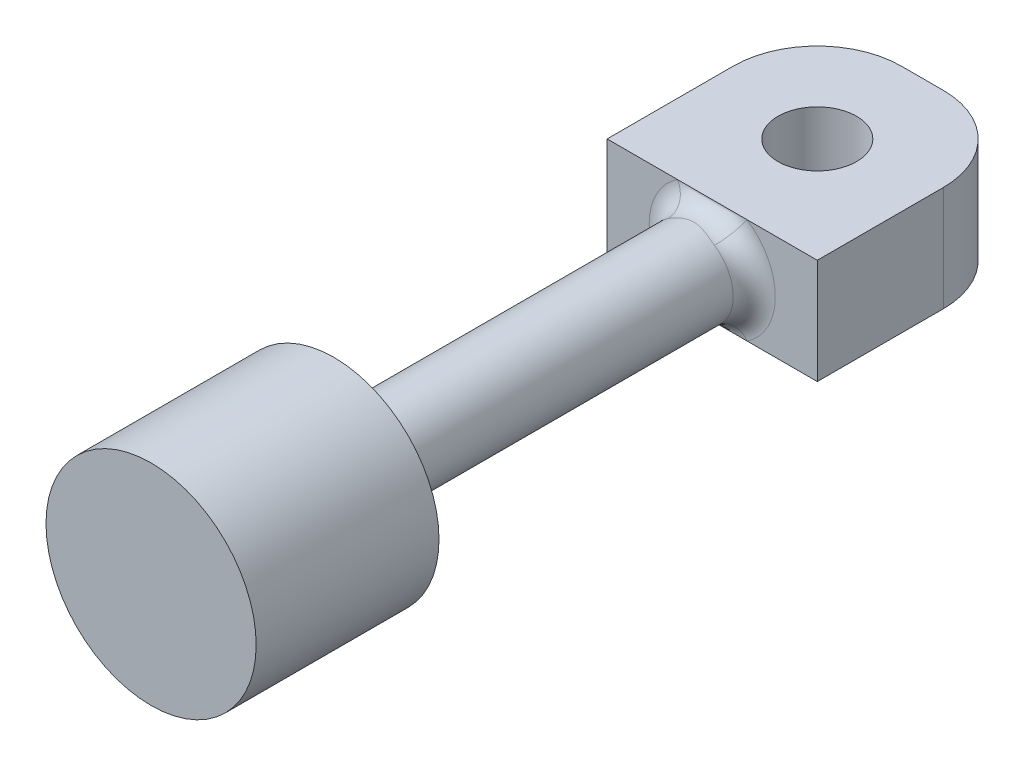
ISO-10303-21;
HEADER;
FILE_DESCRIPTION(('STEP AP214'),'2;1');
FILE_NAME('part.step','',(''),(''),'','','');
FILE_SCHEMA(('AUTOMOTIVE_DESIGN { 1 0 10303 214 1 1 1 1 }'));
ENDSEC;
DATA;
#1=APPLICATION_CONTEXT('core data for automotive mechanical design processes');
#2=APPLICATION_PROTOCOL_DEFINITION('international standard','automotive_design',2000,#1);
#3=PRODUCT_CONTEXT('',#1,'mechanical');
#4=PRODUCT('Part','Part','',(#3));
#5=PRODUCT_RELATED_PRODUCT_CATEGORY('part','',(#4));
#6=PRODUCT_DEFINITION_FORMATION('','',#4);
#7=PRODUCT_DEFINITION_CONTEXT('part definition',#1,'design');
#8=PRODUCT_DEFINITION('design','',#6,#7);
#9=PRODUCT_DEFINITION_SHAPE('','',#8);
#10=(LENGTH_UNIT() NAMED_UNIT(*) SI_UNIT(.MILLI.,.METRE.));
#11=(NAMED_UNIT(*) PLANE_ANGLE_UNIT() SI_UNIT($,.RADIAN.));
#12=(NAMED_UNIT(*) SI_UNIT($,.STERADIAN.) SOLID_ANGLE_UNIT());
#13=UNCERTAINTY_MEASURE_WITH_UNIT(LENGTH_MEASURE(1.E-05),#10,'distance_accuracy_value','');
#14=(GEOMETRIC_REPRESENTATION_CONTEXT(3) GLOBAL_UNCERTAINTY_ASSIGNED_CONTEXT((#13)) GLOBAL_UNIT_ASSIGNED_CONTEXT((#10,
#11,#12)) REPRESENTATION_CONTEXT('',''));
#15=CARTESIAN_POINT('',(0.,0.,0.));
#16=DIRECTION('',(0.,0.,1.));
#17=DIRECTION('',(1.,0.,0.));
#18=AXIS2_PLACEMENT_3D('',#15,#16,#17);
#19=CARTESIAN_POINT('',(0.,-1.25,0.));
#20=DIRECTION('',(0.,0.,1.));
#21=DIRECTION('',(1.,0.,0.));
#22=AXIS2_PLACEMENT_3D('',#19,#20,#21);
#23=PLANE('',#22);
#24=DIRECTION('',(1.,0.,0.));
#25=VECTOR('',#24,1.);
#26=CARTESIAN_POINT('',(0.,-1.25,0.));
#27=LINE('',#26,#25);
#28=CARTESIAN_POINT('',(0.,-1.25,0.));
#29=VERTEX_POINT('',#28);
#30=CARTESIAN_POINT('',(1.67084380241115,-1.25,0.));
#31=VERTEX_POINT('',#30);
#32=EDGE_CURVE('E158',#29,#31,#27,.T.);
#33=ORIENTED_EDGE('',*,*,#32,.T.);
#34=CARTESIAN_POINT('',(2.5,0.,0.));
#35=DIRECTION('',(0.,0.,1.));
#36=DIRECTION('',(1.,0.,0.));
#37=AXIS2_PLACEMENT_3D('',#34,#35,#36);
#38=CIRCLE('',#37,1.5);
#39=CARTESIAN_POINT('',(1.67084380241115,1.25,0.));
#40=VERTEX_POINT('',#39);
#41=EDGE_CURVE('E227',#31,#40,#38,.F.);
#42=ORIENTED_EDGE('',*,*,#41,.T.);
#43=DIRECTION('',(1.,0.,0.));
#44=VECTOR('',#43,1.);
#45=CARTESIAN_POINT('',(0.,1.25,0.));
#46=LINE('',#45,#44);
#47=CARTESIAN_POINT('',(0.,1.25,0.));
#48=VERTEX_POINT('',#47);
#49=EDGE_CURVE('E129',#48,#40,#46,.T.);
#50=ORIENTED_EDGE('',*,*,#49,.F.);
#51=DIRECTION('',(0.,1.,0.));
#52=VECTOR('',#51,1.);
#53=CARTESIAN_POINT('',(0.,-1.25,0.));
#54=LINE('',#53,#52);
#55=EDGE_CURVE('E174',#29,#48,#54,.T.);
#56=ORIENTED_EDGE('',*,*,#55,.F.);
#57=EDGE_LOOP('',(#33,#42,#50,#56));
#58=FACE_BOUND('',#57,.T.);
#59=ADVANCED_FACE('F37',(#58),#23,.T.);
#60=CARTESIAN_POINT('',(2.5,0.,0.));
#61=DIRECTION('',(0.,0.,1.));
#62=DIRECTION('',(1.,0.,0.));
#63=AXIS2_PLACEMENT_3D('',#60,#61,#62);
#64=CYLINDRICAL_SURFACE('',#63,1.);
#65=CARTESIAN_POINT('',(2.5,0.,8.5));
#66=DIRECTION('',(0.,0.,1.));
#67=DIRECTION('',(1.,0.,0.));
#68=AXIS2_PLACEMENT_3D('',#65,#66,#67);
#69=CIRCLE('',#68,1.);
#70=CARTESIAN_POINT('',(3.5,0.,8.5));
#71=VERTEX_POINT('',#70);
#72=EDGE_CURVE('E11',#71,#71,#69,.F.);
#73=ORIENTED_EDGE('',*,*,#72,.T.);
#74=EDGE_LOOP('',(#73));
#75=FACE_BOUND('',#74,.T.);
#76=CARTESIAN_POINT('',(2.5,0.,0.5));
#77=DIRECTION('',(0.,0.,1.));
#78=DIRECTION('',(1.,0.,0.));
#79=AXIS2_PLACEMENT_3D('',#76,#77,#78);
#80=CIRCLE('',#79,1.);
#81=CARTESIAN_POINT('',(1.94722920160743,0.833333333333333,0.5));
#82=VERTEX_POINT('',#81);
#83=CARTESIAN_POINT('',(1.94722920160743,-0.833333333333333,0.5));
#84=VERTEX_POINT('',#83);
#85=EDGE_CURVE('E176',#82,#84,#80,.T.);
#86=ORIENTED_EDGE('',*,*,#85,.T.);
#87=CARTESIAN_POINT('',(1.77625368495232,-0.690066135565932,0.451461678992494));
#88=CARTESIAN_POINT('',(1.92883716273189,-0.850096782033691,-0.190358393908618));
#89=CARTESIAN_POINT('',(1.41438052742847,-1.25,0.));
#90=CARTESIAN_POINT('',(1.79517442832761,-0.709966710720642,0.465607971023034));
#91=CARTESIAN_POINT('',(1.91980847361394,-0.832028730045811,-0.166833125760909));
#92=CARTESIAN_POINT('',(1.44276164249142,-1.25,0.));
#93=CARTESIAN_POINT('',(1.81542331304438,-0.729511061554093,0.476019820260221));
#94=CARTESIAN_POINT('',(1.91504427586367,-0.821844919220158,-0.140470280637435));
#95=CARTESIAN_POINT('',(1.47313496956657,-1.25,0.));
#96=CARTESIAN_POINT('',(1.85781191962799,-0.767050274370984,0.49087949443451));
#97=CARTESIAN_POINT('',(1.91474637960956,-0.813691209952705,-0.0888950609361264));
#98=CARTESIAN_POINT('',(1.53671787944199,-1.25,0.));
#99=CARTESIAN_POINT('',(1.87992758111859,-0.785060201001451,0.495393647500125));
#100=CARTESIAN_POINT('',(1.91871084533525,-0.815066731293708,-0.0636829389507555));
#101=CARTESIAN_POINT('',(1.56989137167788,-1.25,0.));
#102=CARTESIAN_POINT('',(1.93803798822336,-0.828332653107137,0.501505164663201));
#103=CARTESIAN_POINT('',(1.93927814289678,-0.827605678211388,-0.00656457453876137));
#104=CARTESIAN_POINT('',(1.65705698233503,-1.25,0.));
#105=CARTESIAN_POINT('',(1.97510809680122,-0.85229603306466,0.50023428723361));
#106=CARTESIAN_POINT('',(1.96091921167791,-0.843011028846605,0.0233734176193543));
#107=CARTESIAN_POINT('',(1.71266214520183,-1.25,0.));
#108=CARTESIAN_POINT('',(2.05205708319602,-0.895157139300711,0.4923963035708));
#109=CARTESIAN_POINT('',(2.01815471368985,-0.8775967046803,0.0704123197681016));
#110=CARTESIAN_POINT('',(1.82808562479403,-1.25,0.));
#111=CARTESIAN_POINT('',(2.09195344923442,-0.914019070555707,0.485793006307915));
#112=CARTESIAN_POINT('',(2.05342053635577,-0.896785172848845,0.0883220704036785));
#113=CARTESIAN_POINT('',(1.88793017385163,-1.25,0.));
#114=CARTESIAN_POINT('',(2.17638133956542,-0.947344428648788,0.470612726474667));
#115=CARTESIAN_POINT('',(2.13507853923783,-0.933110968533314,0.115526338876348));
#116=CARTESIAN_POINT('',(2.01457200934813,-1.25,0.));
#117=CARTESIAN_POINT('',(2.22104606096117,-0.961448554312796,0.461936386028013));
#118=CARTESIAN_POINT('',(2.18229540717715,-0.950459250408078,0.12482118322152));
#119=CARTESIAN_POINT('',(2.08156909144176,-1.25,0.));
#120=CARTESIAN_POINT('',(2.31196478411317,-0.983267669681309,0.446935958414279));
#121=CARTESIAN_POINT('',(2.28205375020906,-0.977726239563162,0.137257070176644));
#122=CARTESIAN_POINT('',(2.21794717616975,-1.25,0.));
#123=CARTESIAN_POINT('',(2.3582129913156,-0.991003802054727,0.440604125982435));
#124=CARTESIAN_POINT('',(2.3351427742977,-0.988047734390116,0.140660597816397));
#125=CARTESIAN_POINT('',(2.28731948697337,-1.25,0.));
#126=CARTESIAN_POINT('',(2.43238488484835,-0.998095662916237,0.434667301118945));
#127=CARTESIAN_POINT('',(2.42105740886587,-0.997452623083816,0.143608283761576));
#128=CARTESIAN_POINT('',(2.39857732727254,-1.25,0.));
#129=CARTESIAN_POINT('',(2.46005613584839,-0.99958599246396,0.433369379167056));
#130=CARTESIAN_POINT('',(2.45339108808439,-0.999449672236718,0.144176551487355));
#131=CARTESIAN_POINT('',(2.44008420377266,-1.25,0.));
#132=CARTESIAN_POINT('',(2.51544318286278,-1.00026393103126,0.432785955821204));
#133=CARTESIAN_POINT('',(2.51800067470002,-1.00034988540679,0.14444067498318));
#134=CARTESIAN_POINT('',(2.52316477429411,-1.25,0.));
#135=CARTESIAN_POINT('',(2.54315898249787,-0.999451342322642,0.433500627228154));
#136=CARTESIAN_POINT('',(2.55045042932345,-0.999257652779998,0.144137856464308));
#137=CARTESIAN_POINT('',(2.56473847374656,-1.25,0.));
#138=CARTESIAN_POINT('',(2.59845487091523,-0.995528739032176,0.436828721681458));
#139=CARTESIAN_POINT('',(2.61463534493062,-0.994054790126438,0.142557583555506));
#140=CARTESIAN_POINT('',(2.6476823063731,-1.25,0.));
#141=CARTESIAN_POINT('',(2.62603432669167,-0.992412019704754,0.43944768562551));
#142=CARTESIAN_POINT('',(2.64653759219838,-0.989907335839663,0.141268506670842));
#143=CARTESIAN_POINT('',(2.68905149003844,-1.25,0.));
#144=CARTESIAN_POINT('',(2.68076827434398,-0.983915929935954,0.446129671375414));
#145=CARTESIAN_POINT('',(2.70883545774163,-0.978873800329412,0.137311108774016));
#146=CARTESIAN_POINT('',(2.77115241151663,-1.25,0.));
#147=CARTESIAN_POINT('',(2.707922549317,-0.978535441304775,0.45019340667273));
#148=CARTESIAN_POINT('',(2.73938011142874,-0.971929457973244,0.134617682237028));
#149=CARTESIAN_POINT('',(2.8118838239752,-1.25,0.));
#150=CARTESIAN_POINT('',(2.78373250216437,-0.960224985182674,0.462770102378382));
#151=CARTESIAN_POINT('',(2.82300187984199,-0.948892281072629,0.124098705726765));
#152=CARTESIAN_POINT('',(2.92559875324711,-1.25,0.));
#153=CARTESIAN_POINT('',(2.83171631337241,-0.944724761556219,0.472194687807378));
#154=CARTESIAN_POINT('',(2.87355311974939,-0.929850577198626,0.11374334408433));
#155=CARTESIAN_POINT('',(2.99757447006396,-1.25,0.));
#156=CARTESIAN_POINT('',(2.92476870896005,-0.906688344628066,0.488640739025778));
#157=CARTESIAN_POINT('',(2.96220263942754,-0.889067202538646,0.0816781966029243));
#158=CARTESIAN_POINT('',(3.13715306343474,-1.25,0.));
#159=CARTESIAN_POINT('',(2.96985066895664,-0.884187715958376,0.495673983924779));
#160=CARTESIAN_POINT('',(3.00049994604223,-0.866870050222651,0.0592117239336714));
#161=CARTESIAN_POINT('',(3.20477600341427,-1.25,0.));
#162=CARTESIAN_POINT('',(3.03979399461811,-0.84236842856578,0.500393478093026));
#163=CARTESIAN_POINT('',(3.04688763753221,-0.837475084179152,0.0112606835658985));
#164=CARTESIAN_POINT('',(3.30969099193995,-1.25,0.));
#165=CARTESIAN_POINT('',(3.065796864826,-0.825121796302488,0.500625138509801));
#166=CARTESIAN_POINT('',(3.06101388114076,-0.827649045355782,-0.0105711713739422));
#167=CARTESIAN_POINT('',(3.34869529727833,-1.25,0.));
#168=CARTESIAN_POINT('',(3.11614493884474,-0.788264034609287,0.496175958556604));
#169=CARTESIAN_POINT('',(3.080654188027,-0.815287603774195,-0.0592442289666943));
#170=CARTESIAN_POINT('',(3.42421740832696,-1.25,0.));
#171=CARTESIAN_POINT('',(3.14047610644959,-0.768635996734336,0.491457923081184));
#172=CARTESIAN_POINT('',(3.08569534317167,-0.81315584418146,-0.0864070448294501));
#173=CARTESIAN_POINT('',(3.46071415972797,-1.25,0.));
#174=CARTESIAN_POINT('',(3.1636449992085,-0.748047668952692,0.483357321000824));
#175=CARTESIAN_POINT('',(3.08510425327828,-0.817726615140268,-0.114408289333953));
#176=CARTESIAN_POINT('',(3.49546749881274,-1.25,0.));
#177=(BOUNDED_SURFACE() B_SPLINE_SURFACE(3,2,((#87,#88,#89),(#90,#91,#92),(#93,#94,#95),(#96,
#97,#98),(#99,#100,#101),(#102,#103,#104),(#105,#106,#107),(#108,#109,#110),(#111,#112,#113),
(#114,#115,#116),(#117,#118,#119),(#120,#121,#122),(#123,#124,#125),(#126,#127,#128),(#129,#130,
#131),(#132,#133,#134),(#135,#136,#137),(#138,#139,#140),(#141,#142,#143),(#144,#145,#146),
(#147,#148,#149),(#150,#151,#152),(#153,#154,#155),(#156,#157,#158),(#159,#160,#161),(#162,#163,
#164),(#165,#166,#167),(#168,#169,#170),(#171,#172,#173),(#174,#175,#176)),.UNSPECIFIED.,.F.,
.F.,.F.) B_SPLINE_SURFACE_WITH_KNOTS((4,2,2,2,2,2,2,2,2,2,2,2,2,2,4),(3,3),(0.,
0.130040608299928,0.258605761236442,0.456213448509133,0.655173681386589,0.866883089640893,
1.07788672380973,1.20247408451829,1.32707214260187,1.45203420040511,1.57705805587019,
1.80484239277054,2.03148789420838,2.17148758558269,2.31254690942404),(0.,1.),
.UNSPECIFIED.) GEOMETRIC_REPRESENTATION_ITEM() RATIONAL_B_SPLINE_SURFACE(((1.,0.593046572981359,
1.),(1.,0.606805422645073,1.),(1.,0.621347745381121,1.),(1.,0.650713706855895,1.),(1.,
0.665532281656358,1.),(1.,0.702313322712856,1.),(1.,0.723838633182082,1.),(1.,0.763358728971579,
1.),(1.,0.781328340829299,1.),(1.,0.813539016689063,1.),(1.,0.827467373642778,1.),(1.,
0.849163539992706,1.),(1.,0.856951731967779,1.),(1.,0.86410113630927,1.),(1.,0.865607292798284,
1.),(1.,0.866291886128356,1.),(1.,0.865470123094617,1.),(1.,0.861512240342445,1.),(1.,
0.858369366495205,1.),(1.,0.849842672837847,1.),(1.,0.844457745578201,1.),(1.,0.82625126506008,
1.),(1.,0.810955211056081,1.),(1.,0.774309124102591,1.),(1.,0.7529897410997,1.),(1.,
0.715014369295762,1.),(1.,0.69969142357133,1.),(1.,0.668174180580861,1.),(1.,0.65197416601798,
1.),(1.,0.635848556141688,1.))) REPRESENTATION_ITEM('') SURFACE());
#178=CARTESIAN_POINT('',(1.77625368495232,-0.690066135565932,0.451461678992494));
#179=CARTESIAN_POINT('',(1.79517442832761,-0.709966710720642,0.465607971023034));
#180=CARTESIAN_POINT('',(1.81542331304438,-0.729511061554093,0.476019820260221));
#181=CARTESIAN_POINT('',(1.85781191962799,-0.767050274370983,0.49087949443451));
#182=CARTESIAN_POINT('',(1.87992758111859,-0.785060201001451,0.495393647500124));
#183=CARTESIAN_POINT('',(1.93803798822336,-0.828332653107137,0.501505164663201));
#184=CARTESIAN_POINT('',(1.97510809680122,-0.85229603306466,0.50023428723361));
#185=CARTESIAN_POINT('',(2.05205708319602,-0.895157139300711,0.4923963035708));
#186=CARTESIAN_POINT('',(2.09195344923442,-0.914019070555708,0.485793006307915));
#187=CARTESIAN_POINT('',(2.17638133956542,-0.947344428648788,0.470612726474667));
#188=CARTESIAN_POINT('',(2.22104606096117,-0.961448554312796,0.461936386028013));
#189=CARTESIAN_POINT('',(2.31196478411317,-0.983267669681309,0.446935958414279));
#190=CARTESIAN_POINT('',(2.3582129913156,-0.991003802054727,0.440604125982435));
#191=CARTESIAN_POINT('',(2.43238488484835,-0.998095662916237,0.434667301118945));
#192=CARTESIAN_POINT('',(2.46005613584839,-0.99958599246396,0.433369379167056));
#193=CARTESIAN_POINT('',(2.51544318286278,-1.00026393103126,0.432785955821204));
#194=CARTESIAN_POINT('',(2.54315898249787,-0.999451342322642,0.433500627228154));
#195=CARTESIAN_POINT('',(2.59845487091523,-0.995528739032176,0.436828721681458));
#196=CARTESIAN_POINT('',(2.62603432669167,-0.992412019704754,0.43944768562551));
#197=CARTESIAN_POINT('',(2.68076827434398,-0.983915929935954,0.446129671375414));
#198=CARTESIAN_POINT('',(2.707922549317,-0.978535441304775,0.45019340667273));
#199=CARTESIAN_POINT('',(2.78373250216437,-0.960224985182674,0.462770102378382));
#200=CARTESIAN_POINT('',(2.83171631337241,-0.944724761556219,0.472194687807378));
#201=CARTESIAN_POINT('',(2.92476870896005,-0.906688344628066,0.488640739025778));
#202=CARTESIAN_POINT('',(2.96985066895664,-0.884187715958376,0.495673983924779));
#203=CARTESIAN_POINT('',(3.03979399461811,-0.84236842856578,0.500393478093026));
#204=CARTESIAN_POINT('',(3.065796864826,-0.825121796302488,0.500625138509801));
#205=CARTESIAN_POINT('',(3.11614493884474,-0.788264034609288,0.496175958556604));
#206=CARTESIAN_POINT('',(3.14047610644959,-0.768635996734336,0.491457923081184));
#207=CARTESIAN_POINT('',(3.1636449992085,-0.748047668952692,0.483357321000824));
#208=B_SPLINE_CURVE_WITH_KNOTS('',3,(#178,#179,#180,#181,#182,#183,#184,#185,#186,#187,#188,
#189,#190,#191,#192,#193,#194,#195,#196,#197,#198,#199,#200,#201,#202,#203,#204,#205,#206,#207),
.UNSPECIFIED.,.F.,.F.,(4,2,2,2,2,2,2,2,2,2,2,2,2,2,4),(0.,0.130040608299928,0.258605761236442,
0.456213448509133,0.655173681386589,0.866883089640893,1.07788672380973,1.20247408451829,
1.32707214260187,1.45203420040511,1.57705805587019,1.80484239277054,2.03148789420838,
2.17148758558269,2.31254690942404),.UNSPECIFIED.);
#209=CARTESIAN_POINT('',(3.05277079839257,-0.833333333333333,0.5));
#210=VERTEX_POINT('',#209);
#211=EDGE_CURVE('E233',#84,#210,#208,.T.);
#212=ORIENTED_EDGE('',*,*,#211,.T.);
#213=CARTESIAN_POINT('',(2.5,0.,0.5));
#214=DIRECTION('',(0.,0.,1.));
#215=DIRECTION('',(1.,0.,0.));
#216=AXIS2_PLACEMENT_3D('',#213,#214,#215);
#217=CIRCLE('',#216,1.);
#218=CARTESIAN_POINT('',(3.05277079839257,0.833333333333333,0.5));
#219=VERTEX_POINT('',#218);
#220=EDGE_CURVE('E193',#210,#219,#217,.T.);
#221=ORIENTED_EDGE('',*,*,#220,.T.);
#222=CARTESIAN_POINT('',(3.22374631504768,0.690066135565933,0.451461678992494));
#223=CARTESIAN_POINT('',(3.07116283726811,0.850096782033691,-0.190358393908617));
#224=CARTESIAN_POINT('',(3.58561947257153,1.25,0.));
#225=CARTESIAN_POINT('',(3.20482557167239,0.709966710720642,0.465607971023034));
#226=CARTESIAN_POINT('',(3.08019152638606,0.83202873004581,-0.166833125760909));
#227=CARTESIAN_POINT('',(3.55723835750858,1.25,0.));
#228=CARTESIAN_POINT('',(3.18457668695562,0.729511061554093,0.476019820260221));
#229=CARTESIAN_POINT('',(3.08495572413634,0.821844919220157,-0.140470280637435));
#230=CARTESIAN_POINT('',(3.52686503043343,1.25,0.));
#231=CARTESIAN_POINT('',(3.14218808037201,0.767050274370984,0.49087949443451));
#232=CARTESIAN_POINT('',(3.08525362039044,0.813691209952705,-0.0888950609361259));
#233=CARTESIAN_POINT('',(3.46328212055801,1.25,0.));
#234=CARTESIAN_POINT('',(3.12007241888141,0.785060201001451,0.495393647500125));
#235=CARTESIAN_POINT('',(3.08128915466475,0.815066731293708,-0.0636829389507548));
#236=CARTESIAN_POINT('',(3.43010862832212,1.25,0.));
#237=CARTESIAN_POINT('',(3.06196201177664,0.828332653107138,0.501505164663201));
#238=CARTESIAN_POINT('',(3.06072185710322,0.827605678211389,-0.00656457453876042));
#239=CARTESIAN_POINT('',(3.34294301766497,1.25,0.));
#240=CARTESIAN_POINT('',(3.02489190319878,0.85229603306466,0.50023428723361));
#241=CARTESIAN_POINT('',(3.03908078832209,0.843011028846605,0.0233734176193549));
#242=CARTESIAN_POINT('',(3.28733785479817,1.25,0.));
#243=CARTESIAN_POINT('',(2.94794291680398,0.895157139300711,0.4923963035708));
#244=CARTESIAN_POINT('',(2.98184528631015,0.8775967046803,0.070412319768102));
#245=CARTESIAN_POINT('',(3.17191437520597,1.25,0.));
#246=CARTESIAN_POINT('',(2.90804655076558,0.914019070555708,0.485793006307915));
#247=CARTESIAN_POINT('',(2.94657946364423,0.896785172848846,0.088322070403679));
#248=CARTESIAN_POINT('',(3.11206982614837,1.25,0.));
#249=CARTESIAN_POINT('',(2.82361866043458,0.947344428648789,0.470612726474666));
#250=CARTESIAN_POINT('',(2.86492146076217,0.933110968533314,0.115526338876348));
#251=CARTESIAN_POINT('',(2.98542799065187,1.25,0.));
#252=CARTESIAN_POINT('',(2.77895393903883,0.961448554312797,0.461936386028013));
#253=CARTESIAN_POINT('',(2.81770459282284,0.950459250408078,0.12482118322152));
#254=CARTESIAN_POINT('',(2.91843090855823,1.25,0.));
#255=CARTESIAN_POINT('',(2.68803521588682,0.983267669681309,0.446935958414279));
#256=CARTESIAN_POINT('',(2.71794624979093,0.977726239563162,0.137257070176644));
#257=CARTESIAN_POINT('',(2.78205282383025,1.25,0.));
#258=CARTESIAN_POINT('',(2.64178700868439,0.991003802054727,0.440604125982435));
#259=CARTESIAN_POINT('',(2.6648572257023,0.988047734390117,0.140660597816397));
#260=CARTESIAN_POINT('',(2.71268051302663,1.25,0.));
#261=CARTESIAN_POINT('',(2.56761511515165,0.998095662916237,0.434667301118945));
#262=CARTESIAN_POINT('',(2.57894259113413,0.997452623083816,0.143608283761576));
#263=CARTESIAN_POINT('',(2.60142267272745,1.25,0.));
#264=CARTESIAN_POINT('',(2.53994386415161,0.99958599246396,0.433369379167056));
#265=CARTESIAN_POINT('',(2.54660891191561,0.999449672236718,0.144176551487355));
#266=CARTESIAN_POINT('',(2.55991579622734,1.25,0.));
#267=CARTESIAN_POINT('',(2.48455681713721,1.00026393103126,0.432785955821204));
#268=CARTESIAN_POINT('',(2.48199932529997,1.00034988540679,0.14444067498318));
#269=CARTESIAN_POINT('',(2.47683522570589,1.25,0.));
#270=CARTESIAN_POINT('',(2.45684101750212,0.999451342322642,0.433500627228154));
#271=CARTESIAN_POINT('',(2.44954957067654,0.999257652779998,0.144137856464308));
#272=CARTESIAN_POINT('',(2.43526152625344,1.25,0.));
#273=CARTESIAN_POINT('',(2.40154512908476,0.995528739032176,0.436828721681459));
#274=CARTESIAN_POINT('',(2.38536465506937,0.994054790126438,0.142557583555506));
#275=CARTESIAN_POINT('',(2.35231769362689,1.25,0.));
#276=CARTESIAN_POINT('',(2.37396567330833,0.992412019704754,0.43944768562551));
#277=CARTESIAN_POINT('',(2.35346240780162,0.989907335839663,0.141268506670842));
#278=CARTESIAN_POINT('',(2.31094850996156,1.25,0.));
#279=CARTESIAN_POINT('',(2.31923172565602,0.983915929935954,0.446129671375414));
#280=CARTESIAN_POINT('',(2.29116454225837,0.978873800329412,0.137311108774016));
#281=CARTESIAN_POINT('',(2.22884758848336,1.25,0.));
#282=CARTESIAN_POINT('',(2.292077450683,0.978535441304775,0.450193406672731));
#283=CARTESIAN_POINT('',(2.26061988857126,0.971929457973243,0.134617682237028));
#284=CARTESIAN_POINT('',(2.1881161760248,1.25,0.));
#285=CARTESIAN_POINT('',(2.21626749783563,0.960224985182674,0.462770102378383));
#286=CARTESIAN_POINT('',(2.17699812015801,0.948892281072628,0.124098705726765));
#287=CARTESIAN_POINT('',(2.07440124675288,1.25,0.));
#288=CARTESIAN_POINT('',(2.16828368662759,0.944724761556219,0.472194687807378));
#289=CARTESIAN_POINT('',(2.12644688025061,0.929850577198625,0.113743344084329));
#290=CARTESIAN_POINT('',(2.00242552993603,1.25,0.));
#291=CARTESIAN_POINT('',(2.07523129103995,0.906688344628065,0.488640739025778));
#292=CARTESIAN_POINT('',(2.03779736057246,0.889067202538645,0.0816781966029235));
#293=CARTESIAN_POINT('',(1.86284693656525,1.25,0.));
#294=CARTESIAN_POINT('',(2.03014933104335,0.884187715958375,0.495673983924779));
#295=CARTESIAN_POINT('',(1.99950005395777,0.866870050222651,0.0592117239336704));
#296=CARTESIAN_POINT('',(1.79522399658572,1.25,0.));
#297=CARTESIAN_POINT('',(1.96020600538189,0.842368428565779,0.500393478093026));
#298=CARTESIAN_POINT('',(1.95311236246779,0.837475084179151,0.0112606835658975));
#299=CARTESIAN_POINT('',(1.69030900806005,1.25,0.));
#300=CARTESIAN_POINT('',(1.93420313517399,0.825121796302487,0.500625138509801));
#301=CARTESIAN_POINT('',(1.93898611885924,0.827649045355781,-0.0105711713739431));
#302=CARTESIAN_POINT('',(1.65130470272167,1.25,0.));
#303=CARTESIAN_POINT('',(1.88385506115526,0.788264034609287,0.496175958556604));
#304=CARTESIAN_POINT('',(1.919345811973,0.815287603774194,-0.0592442289666952));
#305=CARTESIAN_POINT('',(1.57578259167304,1.25,0.));
#306=CARTESIAN_POINT('',(1.85952389355041,0.768635996734335,0.491457923081184));
#307=CARTESIAN_POINT('',(1.91430465682833,0.813155844181459,-0.086407044829451));
#308=CARTESIAN_POINT('',(1.53928584027202,1.25,0.));
#309=CARTESIAN_POINT('',(1.8363550007915,0.748047668952691,0.483357321000823));
#310=CARTESIAN_POINT('',(1.91489574672173,0.817726615140269,-0.114408289333954));
#311=CARTESIAN_POINT('',(1.50453250118725,1.25,0.));
#312=(BOUNDED_SURFACE() B_SPLINE_SURFACE(3,2,((#222,#223,#224),(#225,#226,#227),(#228,#229,
#230),(#231,#232,#233),(#234,#235,#236),(#237,#238,#239),(#240,#241,#242),(#243,#244,#245),
(#246,#247,#248),(#249,#250,#251),(#252,#253,#254),(#255,#256,#257),(#258,#259,#260),(#261,#262,
#263),(#264,#265,#266),(#267,#268,#269),(#270,#271,#272),(#273,#274,#275),(#276,#277,#278),
(#279,#280,#281),(#282,#283,#284),(#285,#286,#287),(#288,#289,#290),(#291,#292,#293),(#294,#295,
#296),(#297,#298,#299),(#300,#301,#302),(#303,#304,#305),(#306,#307,#308),(#309,#310,#311)),
.UNSPECIFIED.,.F.,.F.,.F.) B_SPLINE_SURFACE_WITH_KNOTS((4,2,2,2,2,2,2,2,2,2,2,2,2,2,4),(3,3),
(0.,0.130040608299928,0.258605761236442,0.456213448509134,0.65517368138659,0.866883089640896,
1.07788672380973,1.20247408451829,1.32707214260187,1.45203420040512,1.57705805587019,
1.80484239277054,2.03148789420838,2.1714875855827,2.31254690942404),(0.,1.),
.UNSPECIFIED.) GEOMETRIC_REPRESENTATION_ITEM() RATIONAL_B_SPLINE_SURFACE(((1.,0.593046572981359,
1.),(1.,0.606805422645073,1.),(1.,0.621347745381121,1.),(1.,0.650713706855895,1.),(1.,
0.665532281656359,1.),(1.,0.702313322712856,1.),(1.,0.723838633182082,1.),(1.,0.76335872897158,
1.),(1.,0.7813283408293,1.),(1.,0.813539016689064,1.),(1.,0.827467373642778,1.),(1.,
0.849163539992707,1.),(1.,0.856951731967779,1.),(1.,0.86410113630927,1.),(1.,0.865607292798284,
1.),(1.,0.866291886128356,1.),(1.,0.865470123094617,1.),(1.,0.861512240342445,1.),(1.,
0.858369366495205,1.),(1.,0.849842672837846,1.),(1.,0.8444577455782,1.),(1.,0.826251265060079,
1.),(1.,0.81095521105608,1.),(1.,0.77430912410259,1.),(1.,0.7529897410997,1.),(1.,
0.715014369295761,1.),(1.,0.699691423571329,1.),(1.,0.66817418058086,1.),(1.,0.65197416601798,
1.),(1.,0.635848556141687,1.))) REPRESENTATION_ITEM('') SURFACE());
#313=CARTESIAN_POINT('',(3.22374631504768,0.690066135565933,0.451461678992494));
#314=CARTESIAN_POINT('',(3.20482557167239,0.709966710720642,0.465607971023034));
#315=CARTESIAN_POINT('',(3.18457668695562,0.729511061554093,0.476019820260221));
#316=CARTESIAN_POINT('',(3.14218808037201,0.767050274370984,0.49087949443451));
#317=CARTESIAN_POINT('',(3.12007241888141,0.785060201001451,0.495393647500125));
#318=CARTESIAN_POINT('',(3.06196201177664,0.828332653107138,0.501505164663201));
#319=CARTESIAN_POINT('',(3.02489190319878,0.85229603306466,0.50023428723361));
#320=CARTESIAN_POINT('',(2.94794291680398,0.895157139300711,0.4923963035708));
#321=CARTESIAN_POINT('',(2.90804655076558,0.914019070555708,0.485793006307915));
#322=CARTESIAN_POINT('',(2.82361866043458,0.947344428648789,0.470612726474666));
#323=CARTESIAN_POINT('',(2.77895393903883,0.961448554312797,0.461936386028013));
#324=CARTESIAN_POINT('',(2.68803521588682,0.983267669681309,0.446935958414279));
#325=CARTESIAN_POINT('',(2.64178700868439,0.991003802054727,0.440604125982435));
#326=CARTESIAN_POINT('',(2.56761511515165,0.998095662916237,0.434667301118945));
#327=CARTESIAN_POINT('',(2.53994386415161,0.999585992463961,0.433369379167056));
#328=CARTESIAN_POINT('',(2.48455681713721,1.00026393103126,0.432785955821204));
#329=CARTESIAN_POINT('',(2.45684101750212,0.999451342322642,0.433500627228154));
#330=CARTESIAN_POINT('',(2.40154512908476,0.995528739032176,0.436828721681459));
#331=CARTESIAN_POINT('',(2.37396567330833,0.992412019704754,0.43944768562551));
#332=CARTESIAN_POINT('',(2.31923172565602,0.983915929935954,0.446129671375414));
#333=CARTESIAN_POINT('',(2.292077450683,0.978535441304775,0.450193406672731));
#334=CARTESIAN_POINT('',(2.21626749783563,0.960224985182674,0.462770102378383));
#335=CARTESIAN_POINT('',(2.16828368662759,0.944724761556219,0.472194687807378));
#336=CARTESIAN_POINT('',(2.07523129103995,0.906688344628065,0.488640739025778));
#337=CARTESIAN_POINT('',(2.03014933104335,0.884187715958375,0.495673983924779));
#338=CARTESIAN_POINT('',(1.96020600538189,0.842368428565779,0.500393478093026));
#339=CARTESIAN_POINT('',(1.93420313517399,0.825121796302487,0.500625138509801));
#340=CARTESIAN_POINT('',(1.88385506115526,0.788264034609287,0.496175958556604));
#341=CARTESIAN_POINT('',(1.85952389355041,0.768635996734336,0.491457923081184));
#342=CARTESIAN_POINT('',(1.8363550007915,0.748047668952691,0.483357321000823));
#343=B_SPLINE_CURVE_WITH_KNOTS('',3,(#313,#314,#315,#316,#317,#318,#319,#320,#321,#322,#323,
#324,#325,#326,#327,#328,#329,#330,#331,#332,#333,#334,#335,#336,#337,#338,#339,#340,#341,#342),
.UNSPECIFIED.,.F.,.F.,(4,2,2,2,2,2,2,2,2,2,2,2,2,2,4),(0.,0.130040608299928,0.258605761236442,
0.456213448509134,0.65517368138659,0.866883089640896,1.07788672380973,1.20247408451829,
1.32707214260187,1.45203420040512,1.57705805587019,1.80484239277054,2.03148789420838,
2.1714875855827,2.31254690942404),.UNSPECIFIED.);
#344=EDGE_CURVE('E185',#219,#82,#343,.T.);
#345=ORIENTED_EDGE('',*,*,#344,.T.);
#346=EDGE_LOOP('',(#86,#212,#221,#345));
#347=FACE_BOUND('',#346,.T.);
#348=ADVANCED_FACE('F195',(#75,#347),#64,.T.);
#349=CARTESIAN_POINT('',(3.32915619758885,1.25,0.));
#350=VERTEX_POINT('',#349);
#351=CARTESIAN_POINT('',(5.,1.25,0.));
#352=VERTEX_POINT('',#351);
#353=EDGE_CURVE('E116',#350,#352,#46,.T.);
#354=ORIENTED_EDGE('',*,*,#353,.F.);
#355=CARTESIAN_POINT('',(2.5,0.,0.));
#356=DIRECTION('',(0.,0.,1.));
#357=DIRECTION('',(1.,0.,0.));
#358=AXIS2_PLACEMENT_3D('',#355,#356,#357);
#359=CIRCLE('',#358,1.5);
#360=CARTESIAN_POINT('',(3.32915619758885,-1.25,0.));
#361=VERTEX_POINT('',#360);
#362=EDGE_CURVE('E52',#350,#361,#359,.F.);
#363=ORIENTED_EDGE('',*,*,#362,.T.);
#364=CARTESIAN_POINT('',(5.,-1.25,0.));
#365=VERTEX_POINT('',#364);
#366=EDGE_CURVE('E133',#361,#365,#27,.T.);
#367=ORIENTED_EDGE('',*,*,#366,.T.);
#368=DIRECTION('',(0.,1.,0.));
#369=VECTOR('',#368,1.);
#370=CARTESIAN_POINT('',(5.,-1.25,0.));
#371=LINE('',#370,#369);
#372=EDGE_CURVE('E131',#365,#352,#371,.T.);
#373=ORIENTED_EDGE('',*,*,#372,.T.);
#374=EDGE_LOOP('',(#354,#363,#367,#373));
#375=FACE_BOUND('',#374,.T.);
#376=ADVANCED_FACE('F132',(#375),#23,.T.);
#377=CARTESIAN_POINT('',(0.,-1.25,0.));
#378=DIRECTION('',(1.,0.,0.));
#379=DIRECTION('',(0.,0.,-1.));
#380=AXIS2_PLACEMENT_3D('',#377,#378,#379);
#381=PLANE('',#380);
#382=ORIENTED_EDGE('',*,*,#55,.T.);
#383=DIRECTION('',(0.,0.,-1.));
#384=VECTOR('',#383,1.);
#385=CARTESIAN_POINT('',(0.,1.25,0.));
#386=LINE('',#385,#384);
#387=CARTESIAN_POINT('',(0.,1.25,-3.));
#388=VERTEX_POINT('',#387);
#389=EDGE_CURVE('E152',#48,#388,#386,.T.);
#390=ORIENTED_EDGE('',*,*,#389,.T.);
#391=DIRECTION('',(0.,1.,0.));
#392=VECTOR('',#391,1.);
#393=CARTESIAN_POINT('',(0.,-1.25,-3.));
#394=LINE('',#393,#392);
#395=CARTESIAN_POINT('',(0.,-1.25,-3.));
#396=VERTEX_POINT('',#395);
#397=EDGE_CURVE('E177',#396,#388,#394,.T.);
#398=ORIENTED_EDGE('',*,*,#397,.F.);
#399=DIRECTION('',(0.,0.,-1.));
#400=VECTOR('',#399,1.);
#401=CARTESIAN_POINT('',(0.,-1.25,0.));
#402=LINE('',#401,#400);
#403=EDGE_CURVE('E138',#29,#396,#402,.T.);
#404=ORIENTED_EDGE('',*,*,#403,.F.);
#405=EDGE_LOOP('',(#382,#390,#398,#404));
#406=FACE_BOUND('',#405,.T.);
#407=ADVANCED_FACE('F266',(#406),#381,.F.);
#408=CARTESIAN_POINT('',(2.,-1.25,-3.));
#409=DIRECTION('',(0.,1.,0.));
#410=DIRECTION('',(0.,0.,1.));
#411=AXIS2_PLACEMENT_3D('',#408,#409,#410);
#412=CYLINDRICAL_SURFACE('',#411,2.);
#413=ORIENTED_EDGE('',*,*,#397,.T.);
#414=CARTESIAN_POINT('',(2.,1.25,-3.));
#415=DIRECTION('',(0.,1.,0.));
#416=DIRECTION('',(0.,0.,1.));
#417=AXIS2_PLACEMENT_3D('',#414,#415,#416);
#418=CIRCLE('',#417,2.);
#419=CARTESIAN_POINT('',(2.,1.25,-5.));
#420=VERTEX_POINT('',#419);
#421=EDGE_CURVE('E149',#388,#420,#418,.F.);
#422=ORIENTED_EDGE('',*,*,#421,.T.);
#423=DIRECTION('',(0.,1.,0.));
#424=VECTOR('',#423,1.);
#425=CARTESIAN_POINT('',(2.,-1.25,-5.));
#426=LINE('',#425,#424);
#427=CARTESIAN_POINT('',(2.,-1.25,-5.));
#428=VERTEX_POINT('',#427);
#429=EDGE_CURVE('E179',#428,#420,#426,.T.);
#430=ORIENTED_EDGE('',*,*,#429,.F.);
#431=CARTESIAN_POINT('',(2.,-1.25,-3.));
#432=DIRECTION('',(0.,1.,0.));
#433=DIRECTION('',(0.,0.,1.));
#434=AXIS2_PLACEMENT_3D('',#431,#432,#433);
#435=CIRCLE('',#434,2.);
#436=EDGE_CURVE('E169',#396,#428,#435,.F.);
#437=ORIENTED_EDGE('',*,*,#436,.F.);
#438=EDGE_LOOP('',(#413,#422,#430,#437));
#439=FACE_BOUND('',#438,.T.);
#440=ADVANCED_FACE('F269',(#439),#412,.T.);
#441=CARTESIAN_POINT('',(0.,-1.25,-5.));
#442=DIRECTION('',(0.,0.,1.));
#443=DIRECTION('',(1.,0.,0.));
#444=AXIS2_PLACEMENT_3D('',#441,#442,#443);
#445=PLANE('',#444);
#446=ORIENTED_EDGE('',*,*,#429,.T.);
#447=DIRECTION('',(1.,0.,0.));
#448=VECTOR('',#447,1.);
#449=CARTESIAN_POINT('',(0.,1.25,-5.));
#450=LINE('',#449,#448);
#451=CARTESIAN_POINT('',(3.,1.25,-5.));
#452=VERTEX_POINT('',#451);
#453=EDGE_CURVE('E143',#420,#452,#450,.T.);
#454=ORIENTED_EDGE('',*,*,#453,.T.);
#455=DIRECTION('',(0.,1.,0.));
#456=VECTOR('',#455,1.);
#457=CARTESIAN_POINT('',(3.,-1.25,-5.));
#458=LINE('',#457,#456);
#459=CARTESIAN_POINT('',(3.,-1.25,-5.));
#460=VERTEX_POINT('',#459);
#461=EDGE_CURVE('E181',#460,#452,#458,.T.);
#462=ORIENTED_EDGE('',*,*,#461,.F.);
#463=DIRECTION('',(1.,0.,0.));
#464=VECTOR('',#463,1.);
#465=CARTESIAN_POINT('',(0.,-1.25,-5.));
#466=LINE('',#465,#464);
#467=EDGE_CURVE('E167',#428,#460,#466,.T.);
#468=ORIENTED_EDGE('',*,*,#467,.F.);
#469=EDGE_LOOP('',(#446,#454,#462,#468));
#470=FACE_BOUND('',#469,.T.);
#471=ADVANCED_FACE('F273',(#470),#445,.F.);
#472=CARTESIAN_POINT('',(3.,-1.25,-3.));
#473=DIRECTION('',(0.,1.,0.));
#474=DIRECTION('',(0.,0.,1.));
#475=AXIS2_PLACEMENT_3D('',#472,#473,#474);
#476=CYLINDRICAL_SURFACE('',#475,2.);
#477=ORIENTED_EDGE('',*,*,#461,.T.);
#478=CARTESIAN_POINT('',(3.,1.25,-3.));
#479=DIRECTION('',(0.,1.,0.));
#480=DIRECTION('',(0.,0.,1.));
#481=AXIS2_PLACEMENT_3D('',#478,#479,#480);
#482=CIRCLE('',#481,2.);
#483=CARTESIAN_POINT('',(5.,1.25,-3.));
#484=VERTEX_POINT('',#483);
#485=EDGE_CURVE('E141',#484,#452,#482,.T.);
#486=ORIENTED_EDGE('',*,*,#485,.F.);
#487=DIRECTION('',(0.,1.,0.));
#488=VECTOR('',#487,1.);
#489=CARTESIAN_POINT('',(5.,-1.25,-3.));
#490=LINE('',#489,#488);
#491=CARTESIAN_POINT('',(5.,-1.25,-3.));
#492=VERTEX_POINT('',#491);
#493=EDGE_CURVE('E137',#492,#484,#490,.T.);
#494=ORIENTED_EDGE('',*,*,#493,.F.);
#495=CARTESIAN_POINT('',(3.,-1.25,-3.));
#496=DIRECTION('',(0.,1.,0.));
#497=DIRECTION('',(0.,0.,1.));
#498=AXIS2_PLACEMENT_3D('',#495,#496,#497);
#499=CIRCLE('',#498,2.);
#500=EDGE_CURVE('E164',#492,#460,#499,.T.);
#501=ORIENTED_EDGE('',*,*,#500,.T.);
#502=EDGE_LOOP('',(#477,#486,#494,#501));
#503=FACE_BOUND('',#502,.T.);
#504=ADVANCED_FACE('F277',(#503),#476,.T.);
#505=CARTESIAN_POINT('',(2.5,-1.25,-2.5));
#506=DIRECTION('',(0.,1.,0.));
#507=DIRECTION('',(0.,0.,1.));
#508=AXIS2_PLACEMENT_3D('',#505,#506,#507);
#509=CYLINDRICAL_SURFACE('',#508,0.935);
#510=CARTESIAN_POINT('',(2.5,-1.25,-2.5));
#511=DIRECTION('',(0.,1.,0.));
#512=DIRECTION('',(0.,0.,1.));
#513=AXIS2_PLACEMENT_3D('',#510,#511,#512);
#514=CIRCLE('',#513,0.935);
#515=CARTESIAN_POINT('',(2.5,-1.25,-1.565));
#516=VERTEX_POINT('',#515);
#517=EDGE_CURVE('E155',#516,#516,#514,.T.);
#518=ORIENTED_EDGE('',*,*,#517,.F.);
#519=EDGE_LOOP('',(#518));
#520=FACE_BOUND('',#519,.T.);
#521=CARTESIAN_POINT('',(2.5,1.25,-2.5));
#522=DIRECTION('',(0.,1.,0.));
#523=DIRECTION('',(0.,0.,1.));
#524=AXIS2_PLACEMENT_3D('',#521,#522,#523);
#525=CIRCLE('',#524,0.935);
#526=CARTESIAN_POINT('',(2.5,1.25,-1.565));
#527=VERTEX_POINT('',#526);
#528=EDGE_CURVE('E127',#527,#527,#525,.T.);
#529=ORIENTED_EDGE('',*,*,#528,.T.);
#530=EDGE_LOOP('',(#529));
#531=FACE_BOUND('',#530,.T.);
#532=ADVANCED_FACE('F280',(#520,#531),#509,.F.);
#533=CARTESIAN_POINT('',(5.,-1.25,0.));
#534=DIRECTION('',(1.,0.,0.));
#535=DIRECTION('',(0.,0.,-1.));
#536=AXIS2_PLACEMENT_3D('',#533,#534,#535);
#537=PLANE('',#536);
#538=ORIENTED_EDGE('',*,*,#493,.T.);
#539=DIRECTION('',(0.,0.,-1.));
#540=VECTOR('',#539,1.);
#541=CARTESIAN_POINT('',(5.,1.25,0.));
#542=LINE('',#541,#540);
#543=EDGE_CURVE('E122',#352,#484,#542,.T.);
#544=ORIENTED_EDGE('',*,*,#543,.F.);
#545=ORIENTED_EDGE('',*,*,#372,.F.);
#546=DIRECTION('',(0.,0.,-1.));
#547=VECTOR('',#546,1.);
#548=CARTESIAN_POINT('',(5.,-1.25,0.));
#549=LINE('',#548,#547);
#550=EDGE_CURVE('E161',#365,#492,#549,.T.);
#551=ORIENTED_EDGE('',*,*,#550,.T.);
#552=EDGE_LOOP('',(#538,#544,#545,#551));
#553=FACE_BOUND('',#552,.T.);
#554=ADVANCED_FACE('F140',(#553),#537,.T.);
#555=CARTESIAN_POINT('',(0.,-1.25,0.));
#556=DIRECTION('',(0.,1.,0.));
#557=DIRECTION('',(0.,0.,1.));
#558=AXIS2_PLACEMENT_3D('',#555,#556,#557);
#559=PLANE('',#558);
#560=ORIENTED_EDGE('',*,*,#517,.T.);
#561=EDGE_LOOP('',(#560));
#562=FACE_BOUND('',#561,.T.);
#563=ORIENTED_EDGE('',*,*,#32,.F.);
#564=ORIENTED_EDGE('',*,*,#403,.T.);
#565=ORIENTED_EDGE('',*,*,#436,.T.);
#566=ORIENTED_EDGE('',*,*,#467,.T.);
#567=ORIENTED_EDGE('',*,*,#500,.F.);
#568=ORIENTED_EDGE('',*,*,#550,.F.);
#569=ORIENTED_EDGE('',*,*,#366,.F.);
#570=EDGE_CURVE('E162',#31,#361,#27,.T.);
#571=ORIENTED_EDGE('',*,*,#570,.F.);
#572=EDGE_LOOP('',(#563,#564,#565,#566,#567,#568,#569,#571));
#573=FACE_BOUND('',#572,.T.);
#574=ADVANCED_FACE('F259',(#562,#573),#559,.F.);
#575=CARTESIAN_POINT('',(0.,1.25,0.));
#576=DIRECTION('',(0.,1.,0.));
#577=DIRECTION('',(0.,0.,1.));
#578=AXIS2_PLACEMENT_3D('',#575,#576,#577);
#579=PLANE('',#578);
#580=ORIENTED_EDGE('',*,*,#528,.F.);
#581=EDGE_LOOP('',(#580));
#582=FACE_BOUND('',#581,.T.);
#583=ORIENTED_EDGE('',*,*,#49,.T.);
#584=EDGE_CURVE('E125',#40,#350,#46,.T.);
#585=ORIENTED_EDGE('',*,*,#584,.T.);
#586=ORIENTED_EDGE('',*,*,#353,.T.);
#587=ORIENTED_EDGE('',*,*,#543,.T.);
#588=ORIENTED_EDGE('',*,*,#485,.T.);
#589=ORIENTED_EDGE('',*,*,#453,.F.);
#590=ORIENTED_EDGE('',*,*,#421,.F.);
#591=ORIENTED_EDGE('',*,*,#389,.F.);
#592=EDGE_LOOP('',(#583,#585,#586,#587,#588,#589,#590,#591));
#593=FACE_BOUND('',#592,.T.);
#594=ADVANCED_FACE('F119',(#582,#593),#579,.T.);
#595=CARTESIAN_POINT('',(3.32915619758884,1.25000000000001,0.5));
#596=DIRECTION('',(0.833333333333338,-0.55277079839256,0.));
#597=DIRECTION('',(0.55277079839256,0.833333333333338,0.));
#598=AXIS2_PLACEMENT_3D('',#595,#596,#597);
#599=CIRCLE('',#598,0.5);
#600=EDGE_CURVE('E240',#350,#219,#599,.F.);
#601=ORIENTED_EDGE('',*,*,#600,.F.);
#602=ORIENTED_EDGE('',*,*,#584,.F.);
#603=CARTESIAN_POINT('',(1.67084380241115,1.25,0.5));
#604=DIRECTION('',(0.833333333333333,0.552770798392567,0.));
#605=DIRECTION('',(-0.552770798392567,0.833333333333333,0.));
#606=AXIS2_PLACEMENT_3D('',#603,#604,#605);
#607=CIRCLE('',#606,0.5);
#608=EDGE_CURVE('E432',#82,#40,#607,.T.);
#609=ORIENTED_EDGE('',*,*,#608,.F.);
#610=ORIENTED_EDGE('',*,*,#344,.F.);
#611=EDGE_LOOP('',(#601,#602,#609,#610));
#612=FACE_BOUND('',#611,.T.);
#613=ADVANCED_FACE('F203',(#612),#312,.F.);
#614=CARTESIAN_POINT('',(2.5,0.,0.5));
#615=DIRECTION('',(0.,0.,1.));
#616=DIRECTION('',(1.,0.,0.));
#617=AXIS2_PLACEMENT_3D('',#614,#615,#616);
#618=TOROIDAL_SURFACE('',#617,1.5,0.5);
#619=ORIENTED_EDGE('',*,*,#608,.T.);
#620=ORIENTED_EDGE('',*,*,#41,.F.);
#621=CARTESIAN_POINT('',(1.67084380241115,-1.25,0.5));
#622=DIRECTION('',(-0.833333333333333,0.552770798392567,0.));
#623=DIRECTION('',(-0.552770798392567,-0.833333333333333,0.));
#624=AXIS2_PLACEMENT_3D('',#621,#622,#623);
#625=CIRCLE('',#624,0.5);
#626=EDGE_CURVE('E60',#84,#31,#625,.T.);
#627=ORIENTED_EDGE('',*,*,#626,.F.);
#628=ORIENTED_EDGE('',*,*,#85,.F.);
#629=EDGE_LOOP('',(#619,#620,#627,#628));
#630=FACE_BOUND('',#629,.T.);
#631=ADVANCED_FACE('F209',(#630),#618,.F.);
#632=CARTESIAN_POINT('',(2.5,0.,0.5));
#633=DIRECTION('',(0.,0.,1.));
#634=DIRECTION('',(1.,0.,0.));
#635=AXIS2_PLACEMENT_3D('',#632,#633,#634);
#636=TOROIDAL_SURFACE('',#635,1.5,0.5);
#637=ORIENTED_EDGE('',*,*,#600,.T.);
#638=ORIENTED_EDGE('',*,*,#220,.F.);
#639=CARTESIAN_POINT('',(3.32915619758885,-1.25,0.5));
#640=DIRECTION('',(0.833333333333333,0.552770798392567,0.));
#641=DIRECTION('',(-0.552770798392567,0.833333333333333,0.));
#642=AXIS2_PLACEMENT_3D('',#639,#640,#641);
#643=CIRCLE('',#642,0.5);
#644=EDGE_CURVE('E236',#361,#210,#643,.T.);
#645=ORIENTED_EDGE('',*,*,#644,.F.);
#646=ORIENTED_EDGE('',*,*,#362,.F.);
#647=EDGE_LOOP('',(#637,#638,#645,#646));
#648=FACE_BOUND('',#647,.T.);
#649=ADVANCED_FACE('F351',(#648),#636,.F.);
#650=ORIENTED_EDGE('',*,*,#626,.T.);
#651=ORIENTED_EDGE('',*,*,#570,.T.);
#652=ORIENTED_EDGE('',*,*,#644,.T.);
#653=ORIENTED_EDGE('',*,*,#211,.F.);
#654=EDGE_LOOP('',(#650,#651,#652,#653));
#655=FACE_BOUND('',#654,.T.);
#656=ADVANCED_FACE('F254',(#655),#177,.F.);
#657=CARTESIAN_POINT('',(2.5,0.,0.));
#658=DIRECTION('',(0.,0.,1.));
#659=DIRECTION('',(1.,0.,0.));
#660=AXIS2_PLACEMENT_3D('',#657,#658,#659);
#661=CYLINDRICAL_SURFACE('',#660,2.5);
#662=CARTESIAN_POINT('',(2.5,0.,13.35));
#663=DIRECTION('',(0.,0.,1.));
#664=DIRECTION('',(1.,0.,0.));
#665=AXIS2_PLACEMENT_3D('',#662,#663,#664);
#666=CIRCLE('',#665,2.5);
#667=CARTESIAN_POINT('',(5.,0.,13.35));
#668=VERTEX_POINT('',#667);
#669=EDGE_CURVE('E437',#668,#668,#666,.T.);
#670=ORIENTED_EDGE('',*,*,#669,.F.);
#671=EDGE_LOOP('',(#670));
#672=FACE_BOUND('',#671,.T.);
#673=CARTESIAN_POINT('',(2.5,0.,9.));
#674=DIRECTION('',(0.,0.,1.));
#675=DIRECTION('',(1.,0.,0.));
#676=AXIS2_PLACEMENT_3D('',#673,#674,#675);
#677=CIRCLE('',#676,2.5);
#678=CARTESIAN_POINT('',(5.,0.,9.));
#679=VERTEX_POINT('',#678);
#680=EDGE_CURVE('E238',#679,#679,#677,.T.);
#681=ORIENTED_EDGE('',*,*,#680,.T.);
#682=EDGE_LOOP('',(#681));
#683=FACE_BOUND('',#682,.T.);
#684=ADVANCED_FACE('F369',(#672,#683),#661,.T.);
#685=CARTESIAN_POINT('',(0.,0.,9.));
#686=DIRECTION('',(0.,0.,1.));
#687=DIRECTION('',(1.,0.,0.));
#688=AXIS2_PLACEMENT_3D('',#685,#686,#687);
#689=PLANE('',#688);
#690=CARTESIAN_POINT('',(2.5,0.,9.));
#691=DIRECTION('',(0.,0.,1.));
#692=DIRECTION('',(1.,0.,0.));
#693=AXIS2_PLACEMENT_3D('',#690,#691,#692);
#694=CIRCLE('',#693,1.5);
#695=CARTESIAN_POINT('',(4.,0.,9.));
#696=VERTEX_POINT('',#695);
#697=EDGE_CURVE('E45',#696,#696,#694,.T.);
#698=ORIENTED_EDGE('',*,*,#697,.T.);
#699=EDGE_LOOP('',(#698));
#700=FACE_BOUND('',#699,.T.);
#701=ORIENTED_EDGE('',*,*,#680,.F.);
#702=EDGE_LOOP('',(#701));
#703=FACE_BOUND('',#702,.T.);
#704=ADVANCED_FACE('F377',(#700,#703),#689,.F.);
#705=CARTESIAN_POINT('',(0.,0.,13.35));
#706=DIRECTION('',(0.,0.,1.));
#707=DIRECTION('',(1.,0.,0.));
#708=AXIS2_PLACEMENT_3D('',#705,#706,#707);
#709=PLANE('',#708);
#710=ORIENTED_EDGE('',*,*,#669,.T.);
#711=EDGE_LOOP('',(#710));
#712=FACE_BOUND('',#711,.T.);
#713=ADVANCED_FACE('F385',(#712),#709,.T.);
#714=CARTESIAN_POINT('',(2.5,0.,8.5));
#715=DIRECTION('',(0.,0.,1.));
#716=DIRECTION('',(1.,0.,0.));
#717=AXIS2_PLACEMENT_3D('',#714,#715,#716);
#718=TOROIDAL_SURFACE('',#717,1.5,0.5);
#719=ORIENTED_EDGE('',*,*,#72,.F.);
#720=EDGE_LOOP('',(#719));
#721=FACE_BOUND('',#720,.T.);
#722=ORIENTED_EDGE('',*,*,#697,.F.);
#723=EDGE_LOOP('',(#722));
#724=FACE_BOUND('',#723,.T.);
#725=ADVANCED_FACE('F39',(#721,#724),#718,.F.);
#726=CLOSED_SHELL('',(#59,#348,#376,#407,#440,#471,#504,#532,#554,#574,#594,#613,#631,#649,#656,
#684,#704,#713,#725));
#727=MANIFOLD_SOLID_BREP('B2',#726);
#728=ADVANCED_BREP_SHAPE_REPRESENTATION('',(#18,#727),#14);
#729=SHAPE_DEFINITION_REPRESENTATION(#9,#728);
ENDSEC;
END-ISO-10303-21;
